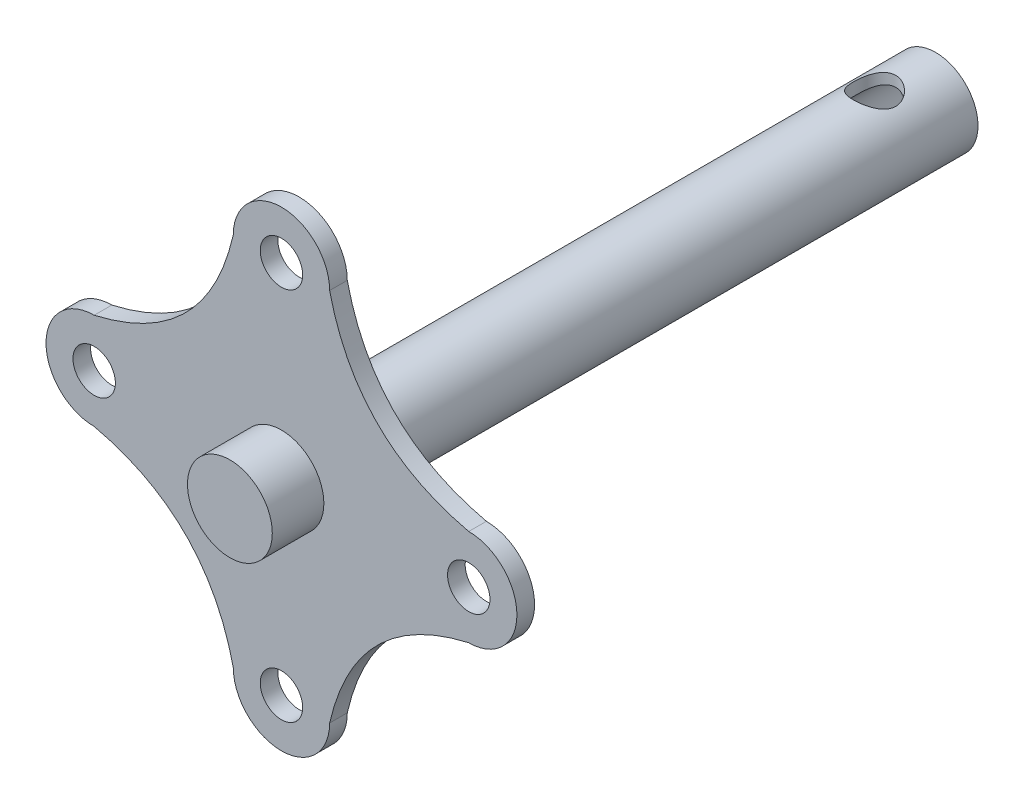
ISO-10303-21;
HEADER;
FILE_DESCRIPTION(('STEP AP214'),'2;1');
FILE_NAME('part.step','',(''),(''),'','','');
FILE_SCHEMA(('AUTOMOTIVE_DESIGN { 1 0 10303 214 1 1 1 1 }'));
ENDSEC;
DATA;
#1=APPLICATION_CONTEXT('core data for automotive mechanical design processes');
#2=APPLICATION_PROTOCOL_DEFINITION('international standard','automotive_design',2000,#1);
#3=PRODUCT_CONTEXT('',#1,'mechanical');
#4=PRODUCT('Part','Part','',(#3));
#5=PRODUCT_RELATED_PRODUCT_CATEGORY('part','',(#4));
#6=PRODUCT_DEFINITION_FORMATION('','',#4);
#7=PRODUCT_DEFINITION_CONTEXT('part definition',#1,'design');
#8=PRODUCT_DEFINITION('design','',#6,#7);
#9=PRODUCT_DEFINITION_SHAPE('','',#8);
#10=(LENGTH_UNIT() NAMED_UNIT(*) SI_UNIT(.MILLI.,.METRE.));
#11=(NAMED_UNIT(*) PLANE_ANGLE_UNIT() SI_UNIT($,.RADIAN.));
#12=(NAMED_UNIT(*) SI_UNIT($,.STERADIAN.) SOLID_ANGLE_UNIT());
#13=UNCERTAINTY_MEASURE_WITH_UNIT(LENGTH_MEASURE(1.E-05),#10,'distance_accuracy_value','');
#14=(GEOMETRIC_REPRESENTATION_CONTEXT(3) GLOBAL_UNCERTAINTY_ASSIGNED_CONTEXT((#13)) GLOBAL_UNIT_ASSIGNED_CONTEXT((#10,
#11,#12)) REPRESENTATION_CONTEXT('',''));
#15=CARTESIAN_POINT('',(0.,0.,0.));
#16=DIRECTION('',(0.,0.,1.));
#17=DIRECTION('',(1.,0.,0.));
#18=AXIS2_PLACEMENT_3D('',#15,#16,#17);
#19=CARTESIAN_POINT('',(-17.9605122421383,17.9605122421383,0.));
#20=DIRECTION('',(0.,0.,1.));
#21=DIRECTION('',(1.,0.,0.));
#22=AXIS2_PLACEMENT_3D('',#19,#20,#21);
#23=PLANE('',#22);
#24=CARTESIAN_POINT('',(-35.052,3.67150211667388E-13,0.));
#25=DIRECTION('',(0.,0.,1.));
#26=DIRECTION('',(1.,0.,0.));
#27=AXIS2_PLACEMENT_3D('',#24,#25,#26);
#28=CIRCLE('',#27,3.96875);
#29=CARTESIAN_POINT('',(-31.08325,3.67150211667388E-13,0.));
#30=VERTEX_POINT('',#29);
#31=EDGE_CURVE('E260',#30,#30,#28,.T.);
#32=ORIENTED_EDGE('',*,*,#31,.T.);
#33=EDGE_LOOP('',(#32));
#34=FACE_BOUND('',#33,.T.);
#35=CARTESIAN_POINT('',(35.052,-1.22383403889129E-13,0.));
#36=DIRECTION('',(0.,0.,1.));
#37=DIRECTION('',(1.,0.,0.));
#38=AXIS2_PLACEMENT_3D('',#35,#36,#37);
#39=CIRCLE('',#38,3.96875);
#40=CARTESIAN_POINT('',(39.02075,-1.22383403889129E-13,0.));
#41=VERTEX_POINT('',#40);
#42=EDGE_CURVE('E271',#41,#41,#39,.T.);
#43=ORIENTED_EDGE('',*,*,#42,.T.);
#44=EDGE_LOOP('',(#43));
#45=FACE_BOUND('',#44,.T.);
#46=CARTESIAN_POINT('',(-9.01700000000001,35.052,0.));
#47=CARTESIAN_POINT('',(-13.8865244842766,13.8865244842766,0.));
#48=CARTESIAN_POINT('',(-35.052,9.017,0.));
#49=B_SPLINE_CURVE_WITH_KNOTS('',2,(#46,#47,#48),.UNSPECIFIED.,.F.,.F.,(3,3),(0.,1.),.UNSPECIFIED.);
#50=CARTESIAN_POINT('',(-9.01700000000001,35.052,0.));
#51=VERTEX_POINT('',#50);
#52=CARTESIAN_POINT('',(-35.052,9.01700000000038,0.));
#53=VERTEX_POINT('',#52);
#54=EDGE_CURVE('E283',#51,#53,#49,.T.);
#55=ORIENTED_EDGE('',*,*,#54,.F.);
#56=CARTESIAN_POINT('',(0.,35.052,0.));
#57=DIRECTION('',(0.,0.,1.));
#58=DIRECTION('',(1.,0.,0.));
#59=AXIS2_PLACEMENT_3D('',#56,#57,#58);
#60=CIRCLE('',#59,9.01700000000001);
#61=CARTESIAN_POINT('',(9.01700000000001,35.052,0.));
#62=VERTEX_POINT('',#61);
#63=EDGE_CURVE('E87',#62,#51,#60,.T.);
#64=ORIENTED_EDGE('',*,*,#63,.F.);
#65=CARTESIAN_POINT('',(35.052,9.01700000000001,0.));
#66=CARTESIAN_POINT('',(13.8865244842766,13.8865244842766,0.));
#67=CARTESIAN_POINT('',(9.01700000000001,35.052,0.));
#68=B_SPLINE_CURVE_WITH_KNOTS('',2,(#65,#66,#67),.UNSPECIFIED.,.F.,.F.,(3,3),(0.,1.),.UNSPECIFIED.);
#69=CARTESIAN_POINT('',(35.052,9.01700000000001,0.));
#70=VERTEX_POINT('',#69);
#71=EDGE_CURVE('E81',#70,#62,#68,.T.);
#72=ORIENTED_EDGE('',*,*,#71,.F.);
#73=CARTESIAN_POINT('',(35.052,-1.22383403889129E-13,0.));
#74=DIRECTION('',(0.,0.,1.));
#75=DIRECTION('',(1.,0.,0.));
#76=AXIS2_PLACEMENT_3D('',#73,#74,#75);
#77=CIRCLE('',#76,9.01700000000001);
#78=CARTESIAN_POINT('',(35.052,-9.01700000000013,0.));
#79=VERTEX_POINT('',#78);
#80=EDGE_CURVE('E124',#79,#70,#77,.T.);
#81=ORIENTED_EDGE('',*,*,#80,.F.);
#82=CARTESIAN_POINT('',(9.01700000000001,-35.052,0.));
#83=CARTESIAN_POINT('',(13.8865244842766,-13.8865244842766,0.));
#84=CARTESIAN_POINT('',(35.052,-9.01700000000001,0.));
#85=B_SPLINE_CURVE_WITH_KNOTS('',2,(#82,#83,#84),.UNSPECIFIED.,.F.,.F.,(3,3),(0.,1.),.UNSPECIFIED.);
#86=CARTESIAN_POINT('',(9.01700000000001,-35.052,0.));
#87=VERTEX_POINT('',#86);
#88=EDGE_CURVE('E331',#87,#79,#85,.T.);
#89=ORIENTED_EDGE('',*,*,#88,.F.);
#90=CARTESIAN_POINT('',(-2.44766807778259E-13,-35.052,0.));
#91=DIRECTION('',(0.,0.,1.));
#92=DIRECTION('',(1.,0.,0.));
#93=AXIS2_PLACEMENT_3D('',#90,#91,#92);
#94=CIRCLE('',#93,9.01700000000001);
#95=CARTESIAN_POINT('',(-9.01700000000026,-35.052,0.));
#96=VERTEX_POINT('',#95);
#97=EDGE_CURVE('E326',#96,#87,#94,.T.);
#98=ORIENTED_EDGE('',*,*,#97,.F.);
#99=CARTESIAN_POINT('',(-35.052,-9.01700000000002,0.));
#100=CARTESIAN_POINT('',(-13.8865244842766,-13.8865244842766,0.));
#101=CARTESIAN_POINT('',(-9.01700000000001,-35.052,0.));
#102=B_SPLINE_CURVE_WITH_KNOTS('',2,(#99,#100,#101),.UNSPECIFIED.,.F.,.F.,(3,3),(0.,1.),.UNSPECIFIED.);
#103=CARTESIAN_POINT('',(-35.052,-9.01700000000002,0.));
#104=VERTEX_POINT('',#103);
#105=EDGE_CURVE('E315',#104,#96,#102,.T.);
#106=ORIENTED_EDGE('',*,*,#105,.F.);
#107=CARTESIAN_POINT('',(-35.052,3.67150211667388E-13,0.));
#108=DIRECTION('',(0.,0.,1.));
#109=DIRECTION('',(1.,0.,0.));
#110=AXIS2_PLACEMENT_3D('',#107,#108,#109);
#111=CIRCLE('',#110,9.01700000000001);
#112=EDGE_CURVE('E312',#53,#104,#111,.T.);
#113=ORIENTED_EDGE('',*,*,#112,.F.);
#114=EDGE_LOOP('',(#55,#64,#72,#81,#89,#98,#106,#113));
#115=FACE_BOUND('',#114,.T.);
#116=CARTESIAN_POINT('',(0.,35.052,0.));
#117=DIRECTION('',(0.,0.,1.));
#118=DIRECTION('',(1.,0.,0.));
#119=AXIS2_PLACEMENT_3D('',#116,#117,#118);
#120=CIRCLE('',#119,3.96875);
#121=CARTESIAN_POINT('',(3.96875,35.052,0.));
#122=VERTEX_POINT('',#121);
#123=EDGE_CURVE('E277',#122,#122,#120,.T.);
#124=ORIENTED_EDGE('',*,*,#123,.T.);
#125=EDGE_LOOP('',(#124));
#126=FACE_BOUND('',#125,.T.);
#127=CARTESIAN_POINT('',(-2.44766807778259E-13,-35.052,0.));
#128=DIRECTION('',(0.,0.,1.));
#129=DIRECTION('',(1.,0.,0.));
#130=AXIS2_PLACEMENT_3D('',#127,#128,#129);
#131=CIRCLE('',#130,3.96875);
#132=CARTESIAN_POINT('',(3.96874999999976,-35.052,0.));
#133=VERTEX_POINT('',#132);
#134=EDGE_CURVE('E266',#133,#133,#131,.T.);
#135=ORIENTED_EDGE('',*,*,#134,.T.);
#136=EDGE_LOOP('',(#135));
#137=FACE_BOUND('',#136,.T.);
#138=CARTESIAN_POINT('',(0.,0.,0.));
#139=DIRECTION('',(0.,0.,1.));
#140=DIRECTION('',(1.,0.,0.));
#141=AXIS2_PLACEMENT_3D('',#138,#139,#140);
#142=CIRCLE('',#141,7.9375);
#143=CARTESIAN_POINT('',(7.9375,0.,0.));
#144=VERTEX_POINT('',#143);
#145=EDGE_CURVE('E11',#144,#144,#142,.F.);
#146=ORIENTED_EDGE('',*,*,#145,.F.);
#147=EDGE_LOOP('',(#146));
#148=FACE_BOUND('',#147,.T.);
#149=ADVANCED_FACE('F34',(#34,#45,#115,#126,#137,#148),#23,.F.);
#150=CARTESIAN_POINT('',(-17.9605122421383,17.9605122421383,3.302));
#151=DIRECTION('',(0.,0.,1.));
#152=DIRECTION('',(1.,0.,0.));
#153=AXIS2_PLACEMENT_3D('',#150,#151,#152);
#154=PLANE('',#153);
#155=CARTESIAN_POINT('',(-35.052,3.67150211667388E-13,3.302));
#156=DIRECTION('',(0.,0.,1.));
#157=DIRECTION('',(1.,0.,0.));
#158=AXIS2_PLACEMENT_3D('',#155,#156,#157);
#159=CIRCLE('',#158,3.96875);
#160=CARTESIAN_POINT('',(-31.08325,3.67150211667388E-13,3.302));
#161=VERTEX_POINT('',#160);
#162=EDGE_CURVE('E263',#161,#161,#159,.T.);
#163=ORIENTED_EDGE('',*,*,#162,.F.);
#164=EDGE_LOOP('',(#163));
#165=FACE_BOUND('',#164,.T.);
#166=CARTESIAN_POINT('',(35.052,-1.22383403889129E-13,3.302));
#167=DIRECTION('',(0.,0.,1.));
#168=DIRECTION('',(1.,0.,0.));
#169=AXIS2_PLACEMENT_3D('',#166,#167,#168);
#170=CIRCLE('',#169,3.96875);
#171=CARTESIAN_POINT('',(39.02075,-1.22383403889129E-13,3.302));
#172=VERTEX_POINT('',#171);
#173=EDGE_CURVE('E274',#172,#172,#170,.T.);
#174=ORIENTED_EDGE('',*,*,#173,.F.);
#175=EDGE_LOOP('',(#174));
#176=FACE_BOUND('',#175,.T.);
#177=CARTESIAN_POINT('',(-9.01700000000001,35.052,3.302));
#178=CARTESIAN_POINT('',(-13.8865244842766,13.8865244842766,3.302));
#179=CARTESIAN_POINT('',(-35.052,9.017,3.302));
#180=B_SPLINE_CURVE_WITH_KNOTS('',2,(#177,#178,#179),.UNSPECIFIED.,.F.,.F.,(3,3),(0.,1.),.UNSPECIFIED.);
#181=CARTESIAN_POINT('',(-9.01700000000001,35.052,3.302));
#182=VERTEX_POINT('',#181);
#183=CARTESIAN_POINT('',(-35.052,9.01700000000038,3.302));
#184=VERTEX_POINT('',#183);
#185=EDGE_CURVE('E285',#182,#184,#180,.T.);
#186=ORIENTED_EDGE('',*,*,#185,.T.);
#187=CARTESIAN_POINT('',(-35.052,3.67150211667388E-13,3.302));
#188=DIRECTION('',(0.,0.,1.));
#189=DIRECTION('',(1.,0.,0.));
#190=AXIS2_PLACEMENT_3D('',#187,#188,#189);
#191=CIRCLE('',#190,9.01700000000001);
#192=CARTESIAN_POINT('',(-35.052,-9.01700000000002,3.302));
#193=VERTEX_POINT('',#192);
#194=EDGE_CURVE('E96',#184,#193,#191,.T.);
#195=ORIENTED_EDGE('',*,*,#194,.T.);
#196=CARTESIAN_POINT('',(-35.052,-9.01700000000002,3.302));
#197=CARTESIAN_POINT('',(-13.8865244842766,-13.8865244842766,3.302));
#198=CARTESIAN_POINT('',(-9.01700000000001,-35.052,3.302));
#199=B_SPLINE_CURVE_WITH_KNOTS('',2,(#196,#197,#198),.UNSPECIFIED.,.F.,.F.,(3,3),(0.,1.),.UNSPECIFIED.);
#200=CARTESIAN_POINT('',(-9.01700000000026,-35.052,3.302));
#201=VERTEX_POINT('',#200);
#202=EDGE_CURVE('E163',#193,#201,#199,.T.);
#203=ORIENTED_EDGE('',*,*,#202,.T.);
#204=CARTESIAN_POINT('',(-2.44766807778259E-13,-35.052,3.302));
#205=DIRECTION('',(0.,0.,1.));
#206=DIRECTION('',(1.,0.,0.));
#207=AXIS2_PLACEMENT_3D('',#204,#205,#206);
#208=CIRCLE('',#207,9.01700000000001);
#209=CARTESIAN_POINT('',(9.01700000000001,-35.052,3.302));
#210=VERTEX_POINT('',#209);
#211=EDGE_CURVE('E158',#201,#210,#208,.T.);
#212=ORIENTED_EDGE('',*,*,#211,.T.);
#213=CARTESIAN_POINT('',(9.01700000000001,-35.052,3.302));
#214=CARTESIAN_POINT('',(13.8865244842766,-13.8865244842766,3.302));
#215=CARTESIAN_POINT('',(35.052,-9.01700000000001,3.302));
#216=B_SPLINE_CURVE_WITH_KNOTS('',2,(#213,#214,#215),.UNSPECIFIED.,.F.,.F.,(3,3),(0.,1.),.UNSPECIFIED.);
#217=CARTESIAN_POINT('',(35.052,-9.01700000000013,3.302));
#218=VERTEX_POINT('',#217);
#219=EDGE_CURVE('E116',#210,#218,#216,.T.);
#220=ORIENTED_EDGE('',*,*,#219,.T.);
#221=CARTESIAN_POINT('',(35.052,-1.22383403889129E-13,3.302));
#222=DIRECTION('',(0.,0.,1.));
#223=DIRECTION('',(1.,0.,0.));
#224=AXIS2_PLACEMENT_3D('',#221,#222,#223);
#225=CIRCLE('',#224,9.01700000000001);
#226=CARTESIAN_POINT('',(35.052,9.01700000000001,3.302));
#227=VERTEX_POINT('',#226);
#228=EDGE_CURVE('E109',#218,#227,#225,.T.);
#229=ORIENTED_EDGE('',*,*,#228,.T.);
#230=CARTESIAN_POINT('',(35.052,9.01700000000001,3.302));
#231=CARTESIAN_POINT('',(13.8865244842766,13.8865244842766,3.302));
#232=CARTESIAN_POINT('',(9.01700000000001,35.052,3.302));
#233=B_SPLINE_CURVE_WITH_KNOTS('',2,(#230,#231,#232),.UNSPECIFIED.,.F.,.F.,(3,3),(0.,1.),.UNSPECIFIED.);
#234=CARTESIAN_POINT('',(9.01700000000001,35.052,3.302));
#235=VERTEX_POINT('',#234);
#236=EDGE_CURVE('E114',#227,#235,#233,.T.);
#237=ORIENTED_EDGE('',*,*,#236,.T.);
#238=CARTESIAN_POINT('',(0.,35.052,3.302));
#239=DIRECTION('',(0.,0.,1.));
#240=DIRECTION('',(1.,0.,0.));
#241=AXIS2_PLACEMENT_3D('',#238,#239,#240);
#242=CIRCLE('',#241,9.01700000000001);
#243=EDGE_CURVE('E52',#235,#182,#242,.T.);
#244=ORIENTED_EDGE('',*,*,#243,.T.);
#245=EDGE_LOOP('',(#186,#195,#203,#212,#220,#229,#237,#244));
#246=FACE_BOUND('',#245,.T.);
#247=CARTESIAN_POINT('',(0.,35.052,3.302));
#248=DIRECTION('',(0.,0.,1.));
#249=DIRECTION('',(1.,0.,0.));
#250=AXIS2_PLACEMENT_3D('',#247,#248,#249);
#251=CIRCLE('',#250,3.96875);
#252=CARTESIAN_POINT('',(3.96875,35.052,3.302));
#253=VERTEX_POINT('',#252);
#254=EDGE_CURVE('E280',#253,#253,#251,.T.);
#255=ORIENTED_EDGE('',*,*,#254,.F.);
#256=EDGE_LOOP('',(#255));
#257=FACE_BOUND('',#256,.T.);
#258=CARTESIAN_POINT('',(-2.44766807778259E-13,-35.052,3.302));
#259=DIRECTION('',(0.,0.,1.));
#260=DIRECTION('',(1.,0.,0.));
#261=AXIS2_PLACEMENT_3D('',#258,#259,#260);
#262=CIRCLE('',#261,3.96875);
#263=CARTESIAN_POINT('',(3.96874999999976,-35.052,3.302));
#264=VERTEX_POINT('',#263);
#265=EDGE_CURVE('E268',#264,#264,#262,.T.);
#266=ORIENTED_EDGE('',*,*,#265,.F.);
#267=EDGE_LOOP('',(#266));
#268=FACE_BOUND('',#267,.T.);
#269=CARTESIAN_POINT('',(0.,0.,3.302));
#270=DIRECTION('',(0.,0.,1.));
#271=DIRECTION('',(1.,0.,0.));
#272=AXIS2_PLACEMENT_3D('',#269,#270,#271);
#273=CIRCLE('',#272,7.9375);
#274=CARTESIAN_POINT('',(7.9375,0.,3.302));
#275=VERTEX_POINT('',#274);
#276=EDGE_CURVE('E256',#275,#275,#273,.T.);
#277=ORIENTED_EDGE('',*,*,#276,.F.);
#278=EDGE_LOOP('',(#277));
#279=FACE_BOUND('',#278,.T.);
#280=ADVANCED_FACE('F111',(#165,#176,#246,#257,#268,#279),#154,.T.);
#281=DIRECTION('',(0.,0.,-1.));
#282=VECTOR('',#281,1.);
#283=SURFACE_OF_LINEAR_EXTRUSION('',#180,#282);
#284=ORIENTED_EDGE('',*,*,#54,.T.);
#285=DIRECTION('',(0.,0.,-1.));
#286=VECTOR('',#285,1.);
#287=CARTESIAN_POINT('',(-35.052,9.01700000000038,3.302));
#288=LINE('',#287,#286);
#289=EDGE_CURVE('E44',#184,#53,#288,.T.);
#290=ORIENTED_EDGE('',*,*,#289,.F.);
#291=ORIENTED_EDGE('',*,*,#185,.F.);
#292=DIRECTION('',(0.,0.,-1.));
#293=VECTOR('',#292,1.);
#294=CARTESIAN_POINT('',(-9.01700000000001,35.052,3.302));
#295=LINE('',#294,#293);
#296=EDGE_CURVE('E130',#182,#51,#295,.T.);
#297=ORIENTED_EDGE('',*,*,#296,.T.);
#298=EDGE_LOOP('',(#284,#290,#291,#297));
#299=FACE_BOUND('',#298,.T.);
#300=ADVANCED_FACE('F36',(#299),#283,.F.);
#301=CARTESIAN_POINT('',(-35.052,3.67150211667388E-13,3.302));
#302=DIRECTION('',(0.,0.,-1.));
#303=DIRECTION('',(-1.,0.,0.));
#304=AXIS2_PLACEMENT_3D('',#301,#302,#303);
#305=CYLINDRICAL_SURFACE('',#304,9.01700000000001);
#306=ORIENTED_EDGE('',*,*,#112,.T.);
#307=DIRECTION('',(0.,0.,-1.));
#308=VECTOR('',#307,1.);
#309=CARTESIAN_POINT('',(-35.052,-9.01700000000002,3.302));
#310=LINE('',#309,#308);
#311=EDGE_CURVE('E309',#193,#104,#310,.T.);
#312=ORIENTED_EDGE('',*,*,#311,.F.);
#313=ORIENTED_EDGE('',*,*,#194,.F.);
#314=ORIENTED_EDGE('',*,*,#289,.T.);
#315=EDGE_LOOP('',(#306,#312,#313,#314));
#316=FACE_BOUND('',#315,.T.);
#317=ADVANCED_FACE('F173',(#316),#305,.T.);
#318=DIRECTION('',(0.,0.,-1.));
#319=VECTOR('',#318,1.);
#320=SURFACE_OF_LINEAR_EXTRUSION('',#199,#319);
#321=ORIENTED_EDGE('',*,*,#105,.T.);
#322=DIRECTION('',(0.,0.,-1.));
#323=VECTOR('',#322,1.);
#324=CARTESIAN_POINT('',(-9.01700000000026,-35.052,3.302));
#325=LINE('',#324,#323);
#326=EDGE_CURVE('E306',#201,#96,#325,.T.);
#327=ORIENTED_EDGE('',*,*,#326,.F.);
#328=ORIENTED_EDGE('',*,*,#202,.F.);
#329=ORIENTED_EDGE('',*,*,#311,.T.);
#330=EDGE_LOOP('',(#321,#327,#328,#329));
#331=FACE_BOUND('',#330,.T.);
#332=ADVANCED_FACE('F171',(#331),#320,.F.);
#333=CARTESIAN_POINT('',(-2.44766807778259E-13,-35.052,3.302));
#334=DIRECTION('',(0.,0.,-1.));
#335=DIRECTION('',(-1.,0.,0.));
#336=AXIS2_PLACEMENT_3D('',#333,#334,#335);
#337=CYLINDRICAL_SURFACE('',#336,9.01700000000001);
#338=ORIENTED_EDGE('',*,*,#97,.T.);
#339=DIRECTION('',(0.,0.,-1.));
#340=VECTOR('',#339,1.);
#341=CARTESIAN_POINT('',(9.01700000000001,-35.052,3.302));
#342=LINE('',#341,#340);
#343=EDGE_CURVE('E303',#210,#87,#342,.T.);
#344=ORIENTED_EDGE('',*,*,#343,.F.);
#345=ORIENTED_EDGE('',*,*,#211,.F.);
#346=ORIENTED_EDGE('',*,*,#326,.T.);
#347=EDGE_LOOP('',(#338,#344,#345,#346));
#348=FACE_BOUND('',#347,.T.);
#349=ADVANCED_FACE('F151',(#348),#337,.T.);
#350=DIRECTION('',(0.,0.,-1.));
#351=VECTOR('',#350,1.);
#352=SURFACE_OF_LINEAR_EXTRUSION('',#216,#351);
#353=ORIENTED_EDGE('',*,*,#88,.T.);
#354=DIRECTION('',(0.,0.,-1.));
#355=VECTOR('',#354,1.);
#356=CARTESIAN_POINT('',(35.052,-9.01700000000013,3.302));
#357=LINE('',#356,#355);
#358=EDGE_CURVE('E125',#218,#79,#357,.T.);
#359=ORIENTED_EDGE('',*,*,#358,.F.);
#360=ORIENTED_EDGE('',*,*,#219,.F.);
#361=ORIENTED_EDGE('',*,*,#343,.T.);
#362=EDGE_LOOP('',(#353,#359,#360,#361));
#363=FACE_BOUND('',#362,.T.);
#364=ADVANCED_FACE('F148',(#363),#352,.F.);
#365=CARTESIAN_POINT('',(35.052,-1.22383403889129E-13,3.302));
#366=DIRECTION('',(0.,0.,-1.));
#367=DIRECTION('',(-1.,0.,0.));
#368=AXIS2_PLACEMENT_3D('',#365,#366,#367);
#369=CYLINDRICAL_SURFACE('',#368,9.01700000000001);
#370=ORIENTED_EDGE('',*,*,#80,.T.);
#371=DIRECTION('',(0.,0.,-1.));
#372=VECTOR('',#371,1.);
#373=CARTESIAN_POINT('',(35.052,9.01700000000001,3.302));
#374=LINE('',#373,#372);
#375=EDGE_CURVE('E121',#227,#70,#374,.T.);
#376=ORIENTED_EDGE('',*,*,#375,.F.);
#377=ORIENTED_EDGE('',*,*,#228,.F.);
#378=ORIENTED_EDGE('',*,*,#358,.T.);
#379=EDGE_LOOP('',(#370,#376,#377,#378));
#380=FACE_BOUND('',#379,.T.);
#381=ADVANCED_FACE('F122',(#380),#369,.T.);
#382=DIRECTION('',(0.,0.,-1.));
#383=VECTOR('',#382,1.);
#384=SURFACE_OF_LINEAR_EXTRUSION('',#233,#383);
#385=ORIENTED_EDGE('',*,*,#71,.T.);
#386=DIRECTION('',(0.,0.,-1.));
#387=VECTOR('',#386,1.);
#388=CARTESIAN_POINT('',(9.01700000000001,35.052,3.302));
#389=LINE('',#388,#387);
#390=EDGE_CURVE('E126',#235,#62,#389,.T.);
#391=ORIENTED_EDGE('',*,*,#390,.F.);
#392=ORIENTED_EDGE('',*,*,#236,.F.);
#393=ORIENTED_EDGE('',*,*,#375,.T.);
#394=EDGE_LOOP('',(#385,#391,#392,#393));
#395=FACE_BOUND('',#394,.T.);
#396=ADVANCED_FACE('F128',(#395),#384,.F.);
#397=CARTESIAN_POINT('',(0.,35.052,3.302));
#398=DIRECTION('',(0.,0.,-1.));
#399=DIRECTION('',(-1.,0.,0.));
#400=AXIS2_PLACEMENT_3D('',#397,#398,#399);
#401=CYLINDRICAL_SURFACE('',#400,9.01700000000001);
#402=ORIENTED_EDGE('',*,*,#63,.T.);
#403=ORIENTED_EDGE('',*,*,#296,.F.);
#404=ORIENTED_EDGE('',*,*,#243,.F.);
#405=ORIENTED_EDGE('',*,*,#390,.T.);
#406=EDGE_LOOP('',(#402,#403,#404,#405));
#407=FACE_BOUND('',#406,.T.);
#408=ADVANCED_FACE('F144',(#407),#401,.T.);
#409=CARTESIAN_POINT('',(0.,35.052,3.302));
#410=DIRECTION('',(0.,0.,-1.));
#411=DIRECTION('',(-1.,0.,0.));
#412=AXIS2_PLACEMENT_3D('',#409,#410,#411);
#413=CYLINDRICAL_SURFACE('',#412,3.96875);
#414=ORIENTED_EDGE('',*,*,#254,.T.);
#415=EDGE_LOOP('',(#414));
#416=FACE_BOUND('',#415,.T.);
#417=ORIENTED_EDGE('',*,*,#123,.F.);
#418=EDGE_LOOP('',(#417));
#419=FACE_BOUND('',#418,.T.);
#420=ADVANCED_FACE('F190',(#416,#419),#413,.F.);
#421=CARTESIAN_POINT('',(35.052,-1.22383403889129E-13,3.302));
#422=DIRECTION('',(0.,0.,-1.));
#423=DIRECTION('',(-1.,0.,0.));
#424=AXIS2_PLACEMENT_3D('',#421,#422,#423);
#425=CYLINDRICAL_SURFACE('',#424,3.96875);
#426=ORIENTED_EDGE('',*,*,#173,.T.);
#427=EDGE_LOOP('',(#426));
#428=FACE_BOUND('',#427,.T.);
#429=ORIENTED_EDGE('',*,*,#42,.F.);
#430=EDGE_LOOP('',(#429));
#431=FACE_BOUND('',#430,.T.);
#432=ADVANCED_FACE('F193',(#428,#431),#425,.F.);
#433=CARTESIAN_POINT('',(-2.44766807778259E-13,-35.052,3.302));
#434=DIRECTION('',(0.,0.,-1.));
#435=DIRECTION('',(-1.,0.,0.));
#436=AXIS2_PLACEMENT_3D('',#433,#434,#435);
#437=CYLINDRICAL_SURFACE('',#436,3.96875);
#438=ORIENTED_EDGE('',*,*,#265,.T.);
#439=EDGE_LOOP('',(#438));
#440=FACE_BOUND('',#439,.T.);
#441=ORIENTED_EDGE('',*,*,#134,.F.);
#442=EDGE_LOOP('',(#441));
#443=FACE_BOUND('',#442,.T.);
#444=ADVANCED_FACE('F197',(#440,#443),#437,.F.);
#445=CARTESIAN_POINT('',(-35.052,3.67150211667388E-13,3.302));
#446=DIRECTION('',(0.,0.,-1.));
#447=DIRECTION('',(-1.,0.,0.));
#448=AXIS2_PLACEMENT_3D('',#445,#446,#447);
#449=CYLINDRICAL_SURFACE('',#448,3.96875);
#450=ORIENTED_EDGE('',*,*,#162,.T.);
#451=EDGE_LOOP('',(#450));
#452=FACE_BOUND('',#451,.T.);
#453=ORIENTED_EDGE('',*,*,#31,.F.);
#454=EDGE_LOOP('',(#453));
#455=FACE_BOUND('',#454,.T.);
#456=ADVANCED_FACE('F201',(#452,#455),#449,.F.);
#457=CARTESIAN_POINT('',(0.,0.,12.954));
#458=DIRECTION('',(0.,0.,-1.));
#459=DIRECTION('',(-1.,0.,0.));
#460=AXIS2_PLACEMENT_3D('',#457,#458,#459);
#461=CYLINDRICAL_SURFACE('',#460,7.9375);
#462=CARTESIAN_POINT('',(0.,0.,12.954));
#463=DIRECTION('',(0.,0.,1.));
#464=DIRECTION('',(1.,0.,0.));
#465=AXIS2_PLACEMENT_3D('',#462,#463,#464);
#466=CIRCLE('',#465,7.9375);
#467=CARTESIAN_POINT('',(7.9375,0.,12.954));
#468=VERTEX_POINT('',#467);
#469=EDGE_CURVE('E257',#468,#468,#466,.T.);
#470=ORIENTED_EDGE('',*,*,#469,.F.);
#471=EDGE_LOOP('',(#470));
#472=FACE_BOUND('',#471,.T.);
#473=ORIENTED_EDGE('',*,*,#276,.T.);
#474=EDGE_LOOP('',(#473));
#475=FACE_BOUND('',#474,.T.);
#476=ADVANCED_FACE('F205',(#472,#475),#461,.T.);
#477=CARTESIAN_POINT('',(0.,0.,12.954));
#478=DIRECTION('',(0.,0.,1.));
#479=DIRECTION('',(1.,0.,0.));
#480=AXIS2_PLACEMENT_3D('',#477,#478,#479);
#481=PLANE('',#480);
#482=ORIENTED_EDGE('',*,*,#469,.T.);
#483=EDGE_LOOP('',(#482));
#484=FACE_BOUND('',#483,.T.);
#485=ADVANCED_FACE('F209',(#484),#481,.T.);
#486=CARTESIAN_POINT('',(0.,0.,-119.126));
#487=DIRECTION('',(0.,0.,1.));
#488=DIRECTION('',(1.,0.,0.));
#489=AXIS2_PLACEMENT_3D('',#486,#487,#488);
#490=CYLINDRICAL_SURFACE('',#489,7.9375);
#491=CARTESIAN_POINT('',(0.,7.93749999999999,-103.72725));
#492=CARTESIAN_POINT('',(0.104369410089829,7.93749964710061,-103.727250401685));
#493=CARTESIAN_POINT('',(0.208746323529613,7.93543652404865,-103.731372000618));
#494=CARTESIAN_POINT('',(0.416729911813045,7.9272367842324,-103.747810186864));
#495=CARTESIAN_POINT('',(0.520336231742607,7.92109839537058,-103.76013033926));
#496=CARTESIAN_POINT('',(0.726110731039585,7.90489272677887,-103.792847002862));
#497=CARTESIAN_POINT('',(0.82827664337823,7.89481984439238,-103.813255031683));
#498=CARTESIAN_POINT('',(1.03030258640491,7.87100738632354,-103.861906916872));
#499=CARTESIAN_POINT('',(1.13016165631416,7.8572663117564,-103.890153976587));
#500=CARTESIAN_POINT('',(1.42440199017918,7.81115458867984,-103.985961135562));
#501=CARTESIAN_POINT('',(1.61448373622076,7.77380867280489,-104.064755457559));
#502=CARTESIAN_POINT('',(1.97834395847019,7.68928332519479,-104.249427407954));
#503=CARTESIAN_POINT('',(2.15212371864541,7.64210466884467,-104.355302900948));
#504=CARTESIAN_POINT('',(2.49041365625516,7.53888923529746,-104.59845990211));
#505=CARTESIAN_POINT('',(2.65372701475934,7.48248923455529,-104.737253901568));
#506=CARTESIAN_POINT('',(2.95584177494967,7.3683815511092,-105.038996425573));
#507=CARTESIAN_POINT('',(3.09462449787672,7.31067290934778,-105.201963184207));
#508=CARTESIAN_POINT('',(3.3546096064078,7.19529548141556,-105.562776026293));
#509=CARTESIAN_POINT('',(3.47361399641898,7.13797684614345,-105.762346919085));
#510=CARTESIAN_POINT('',(3.62524200471708,7.06149696460578,-106.076685051361));
#511=CARTESIAN_POINT('',(3.67131592751051,7.03758021096291,-106.184000173253));
#512=CARTESIAN_POINT('',(3.7540313686651,6.99380755132025,-106.402982213492));
#513=CARTESIAN_POINT('',(3.7906784717335,6.973949242426,-106.514646509907));
#514=CARTESIAN_POINT('',(3.85217834905982,6.94015758970911,-106.734763014468));
#515=CARTESIAN_POINT('',(3.8776017912118,6.92594266308114,-106.84301285339));
#516=CARTESIAN_POINT('',(3.91931981478621,6.9024208871212,-107.061734737486));
#517=CARTESIAN_POINT('',(3.93561923963159,6.89311143390609,-107.172205571333));
#518=CARTESIAN_POINT('',(3.95884711357792,6.87979769947166,-107.394381045861));
#519=CARTESIAN_POINT('',(3.96578120630086,6.87579022326954,-107.506084902556));
#520=CARTESIAN_POINT('',(3.97018212403133,6.87325014427843,-107.729734849304));
#521=CARTESIAN_POINT('',(3.9676498522986,6.87471701913886,-107.841680915226));
#522=CARTESIAN_POINT('',(3.9540316440864,6.882557023164,-108.05136621924));
#523=CARTESIAN_POINT('',(3.94400811209084,6.88832056579457,-108.149198943951));
#524=CARTESIAN_POINT('',(3.91679667622581,6.90382839940708,-108.343552771446));
#525=CARTESIAN_POINT('',(3.89960652217992,6.913573940638,-108.440073452438));
#526=CARTESIAN_POINT('',(3.83755551593145,6.94833703678735,-108.726663670924));
#527=CARTESIAN_POINT('',(3.78220441315265,6.97888716992628,-108.913905648823));
#528=CARTESIAN_POINT('',(3.64414196450859,7.05197183776459,-109.280470189546));
#529=CARTESIAN_POINT('',(3.56082334971471,7.09476894900454,-109.459506695853));
#530=CARTESIAN_POINT('',(3.36963314536097,7.18754170992462,-109.801947919929));
#531=CARTESIAN_POINT('',(3.26175052720868,7.23752058029641,-109.965345569314));
#532=CARTESIAN_POINT('',(3.00858289843047,7.34667673244783,-110.293629109191));
#533=CARTESIAN_POINT('',(2.86028985758813,7.40621681108501,-110.456076683437));
#534=CARTESIAN_POINT('',(2.53820246112426,7.52267817944741,-110.754873984575));
#535=CARTESIAN_POINT('',(2.36439598770339,7.57959820779118,-110.891211238861));
#536=CARTESIAN_POINT('',(2.08304281490361,7.65996142001121,-111.076137772166));
#537=CARTESIAN_POINT('',(1.98335106121145,7.68643989980452,-111.135598308505));
#538=CARTESIAN_POINT('',(1.77856405970502,7.73638797457795,-111.245815178161));
#539=CARTESIAN_POINT('',(1.67347111414213,7.7598588368905,-111.296575180723));
#540=CARTESIAN_POINT('',(1.45861724535511,7.80309870748913,-111.388841629229));
#541=CARTESIAN_POINT('',(1.34885822252743,7.82286920546371,-111.430351800249));
#542=CARTESIAN_POINT('',(1.12546755793707,7.85811727288069,-111.503638532782));
#543=CARTESIAN_POINT('',(1.01183636334388,7.87359533615191,-111.535416214027));
#544=CARTESIAN_POINT('',(0.791208415491776,7.89868242604485,-111.586592263106));
#545=CARTESIAN_POINT('',(0.684441602894769,7.90867135755798,-111.606797912705));
#546=CARTESIAN_POINT('',(0.469303417873443,7.9243478563447,-111.638403897866));
#547=CARTESIAN_POINT('',(0.360932188154226,7.93003580385413,-111.649805011809));
#548=CARTESIAN_POINT('',(0.14351838140585,7.93694735700268,-111.663649139736));
#549=CARTESIAN_POINT('',(0.0344760774196125,7.93817267176881,-111.666095583235));
#550=CARTESIAN_POINT('',(-0.183393594918013,7.93612884272146,-111.662007353531));
#551=CARTESIAN_POINT('',(-0.292220972568113,7.9328598978143,-111.655473077795));
#552=CARTESIAN_POINT('',(-0.500320083529768,7.92234666698602,-111.63436567711));
#553=CARTESIAN_POINT('',(-0.599676397866461,7.91543153005083,-111.620457689248));
#554=CARTESIAN_POINT('',(-0.796761893609953,7.8980306181852,-111.585239665958));
#555=CARTESIAN_POINT('',(-0.894490510702848,7.88754363087236,-111.563927117174));
#556=CARTESIAN_POINT('',(-1.18419302276536,7.85107181593958,-111.489197132444));
#557=CARTESIAN_POINT('',(-1.37287107818242,7.82006600845009,-111.424967907383));
#558=CARTESIAN_POINT('',(-1.74186943050378,7.74637387784252,-111.26787687632));
#559=CARTESIAN_POINT('',(-1.92179650921422,7.70337892840573,-111.174248904181));
#560=CARTESIAN_POINT('',(-2.26401140510817,7.60983879747084,-110.961853583195));
#561=CARTESIAN_POINT('',(-2.42629166335538,7.55929040232657,-110.843075525123));
#562=CARTESIAN_POINT('',(-2.74545105225973,7.4496720486414,-110.570334326544));
#563=CARTESIAN_POINT('',(-2.90023484753893,7.39025272428329,-110.414061404438));
#564=CARTESIAN_POINT('',(-3.18238412157331,7.27321792607378,-110.077512368849));
#565=CARTESIAN_POINT('',(-3.30973063302717,7.21560372346056,-109.897219789113));
#566=CARTESIAN_POINT('',(-3.48032517112611,7.13410756555508,-109.606959063816));
#567=CARTESIAN_POINT('',(-3.53478285096046,7.10720459960475,-109.504277833427));
#568=CARTESIAN_POINT('',(-3.63472626965576,7.05661423482835,-109.293899677459));
#569=CARTESIAN_POINT('',(-3.68021633321872,7.03292528774383,-109.186205200687));
#570=CARTESIAN_POINT('',(-3.76169238454403,6.98968572556066,-108.96657383624));
#571=CARTESIAN_POINT('',(-3.79768600142671,6.97013179105682,-108.854640437156));
#572=CARTESIAN_POINT('',(-3.85972848253965,6.93596861212021,-108.627314029593));
#573=CARTESIAN_POINT('',(-3.88577888656023,6.92135860211885,-108.511921559768));
#574=CARTESIAN_POINT('',(-3.92552100991457,6.89888830107335,-108.289911399127));
#575=CARTESIAN_POINT('',(-3.94015890862892,6.89051477606184,-108.183514470474));
#576=CARTESIAN_POINT('',(-3.96076406455219,6.87869148958232,-107.969617858473));
#577=CARTESIAN_POINT('',(-3.96673223020604,6.87524121223989,-107.862118291853));
#578=CARTESIAN_POINT('',(-3.96990399660637,6.873410736258,-107.646978499338));
#579=CARTESIAN_POINT('',(-3.96711067808675,6.87502875549179,-107.539338336185));
#580=CARTESIAN_POINT('',(-3.95282195577091,6.88325209939153,-107.324861205598));
#581=CARTESIAN_POINT('',(-3.94132690821957,6.88985721988777,-107.218024205465));
#582=CARTESIAN_POINT('',(-3.89701731529281,6.91507935211119,-106.920307676529));
#583=CARTESIAN_POINT('',(-3.85448259337964,6.93908910453775,-106.731230741025));
#584=CARTESIAN_POINT('',(-3.74322760725249,6.99972091146971,-106.363225782623));
#585=CARTESIAN_POINT('',(-3.67449891980817,7.03634702267057,-106.184301045669));
#586=CARTESIAN_POINT('',(-3.50764414414007,7.1210708289439,-105.82821838831));
#587=CARTESIAN_POINT('',(-3.4078532129875,7.16977392107559,-105.651986816236));
#588=CARTESIAN_POINT('',(-3.18353453279148,7.2721522858031,-105.317625380928));
#589=CARTESIAN_POINT('',(-3.05899391421101,7.32583013743155,-105.15950500301));
#590=CARTESIAN_POINT('',(-2.77100358220972,7.4399095177021,-104.845878988688));
#591=CARTESIAN_POINT('',(-2.60466485397247,7.50033552370546,-104.693025538576));
#592=CARTESIAN_POINT('',(-2.24689081707859,7.61515429445718,-104.41675242424));
#593=CARTESIAN_POINT('',(-2.0554420667032,7.66954379879205,-104.293348625268));
#594=CARTESIAN_POINT('',(-1.752233949863,7.74238841685192,-104.133149690033));
#595=CARTESIAN_POINT('',(-1.64802750917782,7.76528966617126,-104.083749277664));
#596=CARTESIAN_POINT('',(-1.43509626570137,7.80744204084633,-103.994000654147));
#597=CARTESIAN_POINT('',(-1.32637371391815,7.82669495867774,-103.953647995917));
#598=CARTESIAN_POINT('',(-1.10545166494248,7.86093871740178,-103.882550814507));
#599=CARTESIAN_POINT('',(-0.993260348832235,7.87593884757798,-103.851785335421));
#600=CARTESIAN_POINT('',(-0.766157034396538,7.90126228219691,-103.800165779984));
#601=CARTESIAN_POINT('',(-0.65124674319286,7.91158844330997,-103.779305649226));
#602=CARTESIAN_POINT('',(-0.446914305999841,7.92540632621577,-103.751479594592));
#603=CARTESIAN_POINT('',(-0.357842962446189,7.92993350293085,-103.742401309177));
#604=CARTESIAN_POINT('',(-0.179182931830079,7.9359805327966,-103.730286256094));
#605=CARTESIAN_POINT('',(-0.0895942305566305,7.93750030294076,-103.72724965518));
#606=CARTESIAN_POINT('',(0.,7.93749999999999,-103.72725));
#607=B_SPLINE_CURVE_WITH_KNOTS('',3,(#491,#492,#493,#494,#495,#496,#497,#498,#499,#500,#501,
#502,#503,#504,#505,#506,#507,#508,#509,#510,#511,#512,#513,#514,#515,#516,#517,#518,#519,#520,
#521,#522,#523,#524,#525,#526,#527,#528,#529,#530,#531,#532,#533,#534,#535,#536,#537,#538,#539,
#540,#541,#542,#543,#544,#545,#546,#547,#548,#549,#550,#551,#552,#553,#554,#555,#556,#557,#558,
#559,#560,#561,#562,#563,#564,#565,#566,#567,#568,#569,#570,#571,#572,#573,#574,#575,#576,#577,
#578,#579,#580,#581,#582,#583,#584,#585,#586,#587,#588,#589,#590,#591,#592,#593,#594,#595,#596,
#597,#598,#599,#600,#601,#602,#603,#604,#605,#606),.UNSPECIFIED.,.T.,.F.,(4,2,2,2,2,2,2,2,2,2,2,
2,2,2,2,2,2,2,2,2,2,2,2,2,2,2,2,2,2,2,2,2,2,2,2,2,2,2,2,2,2,2,2,2,2,2,2,2,2,2,2,2,2,2,2,2,2,4),
(0.,0.313019515128351,0.626175233580018,0.939778516116712,1.25351013887969,1.87785009933137,
2.50214084452941,3.16419977463372,3.82676067541077,4.54070318744182,4.89791582095783,
5.25491634195222,5.5907403388691,5.92638589641845,6.2618291009652,6.59724029907381,
6.89242045929007,7.18769337007426,7.7778104396881,8.38167306557457,8.98580734640278,
9.66654401807603,10.3476050632731,10.7043834335805,11.0610109688386,11.4174946231157,
11.773937248231,12.1008595463039,12.4277529388723,12.7545211225897,13.0812748447114,
13.382601220787,13.6840299772615,14.2863280775274,14.905847348907,15.5256309518745,
16.2062779227394,16.8873939234647,17.2448954524988,17.6022241496148,17.9592649009089,
18.3162503389791,18.6389736088749,18.9616630602592,19.2842390595328,19.6068018534042,
20.1898457717762,20.7730773388125,21.3954935434924,22.0182342479126,22.7166422369348,
23.4154256304279,23.7677430677371,24.1198869552545,24.4712556289908,24.8224092597297,
25.0911083791426,25.3598149147358),.UNSPECIFIED.);
#608=CARTESIAN_POINT('',(0.,7.93749999999999,-103.72725));
#609=VERTEX_POINT('',#608);
#610=EDGE_CURVE('E236',#609,#609,#607,.T.);
#611=ORIENTED_EDGE('',*,*,#610,.F.);
#612=EDGE_LOOP('',(#611));
#613=FACE_BOUND('',#612,.T.);
#614=CARTESIAN_POINT('',(0.,0.,-119.126));
#615=DIRECTION('',(0.,0.,-1.));
#616=DIRECTION('',(-1.,0.,0.));
#617=AXIS2_PLACEMENT_3D('',#614,#615,#616);
#618=CIRCLE('',#617,7.9375);
#619=CARTESIAN_POINT('',(-7.9375,0.,-119.126));
#620=VERTEX_POINT('',#619);
#621=EDGE_CURVE('E251',#620,#620,#618,.T.);
#622=ORIENTED_EDGE('',*,*,#621,.F.);
#623=EDGE_LOOP('',(#622));
#624=FACE_BOUND('',#623,.T.);
#625=ORIENTED_EDGE('',*,*,#145,.T.);
#626=EDGE_LOOP('',(#625));
#627=FACE_BOUND('',#626,.T.);
#628=ADVANCED_FACE('F213',(#613,#624,#627),#490,.T.);
#629=CARTESIAN_POINT('',(0.,0.,-119.126));
#630=DIRECTION('',(0.,0.,-1.));
#631=DIRECTION('',(-1.,0.,0.));
#632=AXIS2_PLACEMENT_3D('',#629,#630,#631);
#633=PLANE('',#632);
#634=CARTESIAN_POINT('',(0.,0.,-119.126));
#635=DIRECTION('',(0.,0.,-1.));
#636=DIRECTION('',(-1.,0.,0.));
#637=AXIS2_PLACEMENT_3D('',#634,#635,#636);
#638=CIRCLE('',#637,6.);
#639=CARTESIAN_POINT('',(-6.,0.,-119.126));
#640=VERTEX_POINT('',#639);
#641=EDGE_CURVE('E241',#640,#640,#638,.T.);
#642=ORIENTED_EDGE('',*,*,#641,.F.);
#643=EDGE_LOOP('',(#642));
#644=FACE_BOUND('',#643,.T.);
#645=ORIENTED_EDGE('',*,*,#621,.T.);
#646=EDGE_LOOP('',(#645));
#647=FACE_BOUND('',#646,.T.);
#648=ADVANCED_FACE('F217',(#644,#647),#633,.T.);
#649=CARTESIAN_POINT('',(0.,0.,-93.726));
#650=DIRECTION('',(0.,0.,-1.));
#651=DIRECTION('',(-1.,0.,0.));
#652=AXIS2_PLACEMENT_3D('',#649,#650,#651);
#653=CYLINDRICAL_SURFACE('',#652,6.);
#654=CARTESIAN_POINT('',(0.,5.99999999999999,-103.72725));
#655=CARTESIAN_POINT('',(-0.199688241899246,5.99999480449547,-103.727255934771));
#656=CARTESIAN_POINT('',(-0.399412118749351,5.98994170323583,-103.74240720941));
#657=CARTESIAN_POINT('',(-0.792503156233868,5.95071732686105,-103.802093551846));
#658=CARTESIAN_POINT('',(-0.985866536799252,5.92153489123459,-103.846645772959));
#659=CARTESIAN_POINT('',(-1.35997338842435,5.84694145233489,-103.962416682267));
#660=CARTESIAN_POINT('',(-1.54077142559262,5.80160664129876,-104.033510246559));
#661=CARTESIAN_POINT('',(-1.88716194632441,5.69836174167826,-104.199357190159));
#662=CARTESIAN_POINT('',(-2.0527523853595,5.64044996574229,-104.2941137444));
#663=CARTESIAN_POINT('',(-2.37976318975356,5.51091809413261,-104.513285286984));
#664=CARTESIAN_POINT('',(-2.53965621988328,5.43855405571732,-104.639526681582));
#665=CARTESIAN_POINT('',(-2.83750393678586,5.28926719148151,-104.913804374019));
#666=CARTESIAN_POINT('',(-2.97542690791732,5.212337991299,-105.061871596541));
#667=CARTESIAN_POINT('',(-3.17426637118122,5.09227759438559,-105.310918142459));
#668=CARTESIAN_POINT('',(-3.24311435969634,5.04858615703532,-105.40539350876));
#669=CARTESIAN_POINT('',(-3.37255445584984,4.96305337538249,-105.600625143378));
#670=CARTESIAN_POINT('',(-3.43314473087889,4.92121244314408,-105.701382798698));
#671=CARTESIAN_POINT('',(-3.60166737352307,4.80072642451339,-106.012433511099));
#672=CARTESIAN_POINT('',(-3.69675565692832,4.72686166894306,-106.232006932129));
#673=CARTESIAN_POINT('',(-3.82558161059636,4.62274474361867,-106.625614176715));
#674=CARTESIAN_POINT('',(-3.86908126731148,4.58606252379742,-106.794785160478));
#675=CARTESIAN_POINT('',(-3.93354187930729,4.53090363229434,-107.140170342465));
#676=CARTESIAN_POINT('',(-3.95454076640918,4.51239632573814,-107.316372166166));
#677=CARTESIAN_POINT('',(-3.97267380249735,4.49644763048188,-107.671677587412));
#678=CARTESIAN_POINT('',(-3.96971547066543,4.49908787615954,-107.850789763677));
#679=CARTESIAN_POINT('',(-3.93993533193668,4.52518074305671,-108.205537345464));
#680=CARTESIAN_POINT('',(-3.91309335034085,4.54865095946656,-108.381169683297));
#681=CARTESIAN_POINT('',(-3.83885271800793,4.61144409190743,-108.717079273625));
#682=CARTESIAN_POINT('',(-3.79234456661841,4.65007559830046,-108.877690951433));
#683=CARTESIAN_POINT('',(-3.68094105863484,4.73874764824864,-109.188988138361));
#684=CARTESIAN_POINT('',(-3.61603966502415,4.78879193664382,-109.339670368397));
#685=CARTESIAN_POINT('',(-3.45471343619861,4.90681399522487,-109.659189296692));
#686=CARTESIAN_POINT('',(-3.3545710126125,4.97637313445497,-109.825560062367));
#687=CARTESIAN_POINT('',(-3.132083186795,5.11933473524399,-110.141068190503));
#688=CARTESIAN_POINT('',(-3.009710538925,5.19274183348345,-110.290184033878));
#689=CARTESIAN_POINT('',(-2.7163744308966,5.35301274064015,-110.598858366632));
#690=CARTESIAN_POINT('',(-2.54060023243892,5.43948670971388,-110.754098503529));
#691=CARTESIAN_POINT('',(-2.16105521366338,5.6010946277321,-111.033082698374));
#692=CARTESIAN_POINT('',(-1.9573117617737,5.67623951339386,-111.156857212443));
#693=CARTESIAN_POINT('',(-1.56837751755918,5.79422112579277,-111.346799114572));
#694=CARTESIAN_POINT('',(-1.38743291423213,5.84050599787016,-111.419510678165));
#695=CARTESIAN_POINT('',(-1.01370922497883,5.91681157823586,-111.538097215872));
#696=CARTESIAN_POINT('',(-0.820940215797119,5.94684592657038,-111.583994699253));
#697=CARTESIAN_POINT('',(-0.427860368662627,5.98799791522144,-111.646653388107));
#698=CARTESIAN_POINT('',(-0.22752189370409,5.99903763371252,-111.663294581311));
#699=CARTESIAN_POINT('',(0.173464236792857,6.00084060614348,-111.666021339139));
#700=CARTESIAN_POINT('',(0.374111879362019,5.99160468866438,-111.652108152395));
#701=CARTESIAN_POINT('',(0.755919043539722,5.95507667050708,-111.596551853701));
#702=CARTESIAN_POINT('',(0.937485270228521,5.92903131173169,-111.556822227569));
#703=CARTESIAN_POINT('',(1.29079381527299,5.86226939374606,-111.453489827964));
#704=CARTESIAN_POINT('',(1.46253455296001,5.82155048158574,-111.389883225676));
#705=CARTESIAN_POINT('',(1.80350866629869,5.72544404559256,-111.23654854987));
#706=CARTESIAN_POINT('',(1.9718891492285,5.66928879564898,-111.145417370292));
#707=CARTESIAN_POINT('',(2.29158447362555,5.54778714833963,-110.941857006495));
#708=CARTESIAN_POINT('',(2.44288810981525,5.48243477857779,-110.829413966262));
#709=CARTESIAN_POINT('',(2.74929017936081,5.33615525241409,-110.566423609391));
#710=CARTESIAN_POINT('',(2.90123608302176,5.25439586436395,-110.412664347605));
#711=CARTESIAN_POINT('',(3.17851953670356,5.09145217289594,-110.082322806009));
#712=CARTESIAN_POINT('',(3.30384100144254,5.01026824561032,-109.905726832337));
#713=CARTESIAN_POINT('',(3.51479025381925,4.86426641514167,-109.549598625512));
#714=CARTESIAN_POINT('',(3.60307908492691,4.79862530410086,-109.371988596684));
#715=CARTESIAN_POINT('',(3.75320665391248,4.68214786816462,-109.001448456547));
#716=CARTESIAN_POINT('',(3.81509313709127,4.63128487252686,-108.808546754131));
#717=CARTESIAN_POINT('',(3.90111325521458,4.5589412008375,-108.444980395906));
#718=CARTESIAN_POINT('',(3.9298853699327,4.53392895149,-108.276133789411));
#719=CARTESIAN_POINT('',(3.96529068740479,4.50300608981435,-107.934463426665));
#720=CARTESIAN_POINT('',(3.9719457320021,4.49707663234535,-107.761643764011));
#721=CARTESIAN_POINT('',(3.9626886283762,4.50523293593088,-107.417086872794));
#722=CARTESIAN_POINT('',(3.94677300758952,4.51932177686032,-107.245349814878));
#723=CARTESIAN_POINT('',(3.89342868495316,4.56534867933065,-106.907640953491));
#724=CARTESIAN_POINT('',(3.85597151056696,4.59731036274212,-106.741677089227));
#725=CARTESIAN_POINT('',(3.7483858394138,4.6856856034456,-106.374403200005));
#726=CARTESIAN_POINT('',(3.67209903354383,4.74640996183613,-106.175953725852));
#727=CARTESIAN_POINT('',(3.49135681473403,4.88088977376916,-105.797156552262));
#728=CARTESIAN_POINT('',(3.38686217614804,4.95466332381565,-105.61683454364));
#729=CARTESIAN_POINT('',(3.15032847505382,5.1083951249131,-105.273048448887));
#730=CARTESIAN_POINT('',(3.01784142115897,5.18843870781307,-105.109932628655));
#731=CARTESIAN_POINT('',(2.72810542536272,5.34646019132039,-104.80593725446));
#732=CARTESIAN_POINT('',(2.57084925816244,5.4244374813996,-104.665064212935));
#733=CARTESIAN_POINT('',(2.30687670168467,5.53978244739492,-104.464335910648));
#734=CARTESIAN_POINT('',(2.20787706267843,5.58007747811434,-104.395868042238));
#735=CARTESIAN_POINT('',(2.00300850877088,5.65684570932489,-104.267658953898));
#736=CARTESIAN_POINT('',(1.89714288462219,5.69332071908751,-104.207913597405));
#737=CARTESIAN_POINT('',(1.67921924892099,5.76135666279718,-104.097935107499));
#738=CARTESIAN_POINT('',(1.56716843689995,5.79292315336017,-104.047691203969));
#739=CARTESIAN_POINT('',(1.33764362741478,5.85018926805326,-103.95743035442));
#740=CARTESIAN_POINT('',(1.22017179484732,5.87589121024086,-103.917409366879));
#741=CARTESIAN_POINT('',(0.923721266631328,5.93118314039515,-103.831875873456));
#742=CARTESIAN_POINT('',(0.742060144041873,5.95680917391995,-103.792803290004));
#743=CARTESIAN_POINT('',(0.373607717885417,5.9912151482713,-103.740495070529));
#744=CARTESIAN_POINT('',(0.186819453942688,6.00000486068337,-103.727244447692));
#745=CARTESIAN_POINT('',(0.,5.99999999999999,-103.72725));
#746=B_SPLINE_CURVE_WITH_KNOTS('',3,(#654,#655,#656,#657,#658,#659,#660,#661,#662,#663,#664,
#665,#666,#667,#668,#669,#670,#671,#672,#673,#674,#675,#676,#677,#678,#679,#680,#681,#682,#683,
#684,#685,#686,#687,#688,#689,#690,#691,#692,#693,#694,#695,#696,#697,#698,#699,#700,#701,#702,
#703,#704,#705,#706,#707,#708,#709,#710,#711,#712,#713,#714,#715,#716,#717,#718,#719,#720,#721,
#722,#723,#724,#725,#726,#727,#728,#729,#730,#731,#732,#733,#734,#735,#736,#737,#738,#739,#740,
#741,#742,#743,#744,#745),.UNSPECIFIED.,.T.,.F.,(4,2,2,2,2,2,2,2,2,2,2,2,2,2,2,2,2,2,2,2,2,2,2,
2,2,2,2,2,2,2,2,2,2,2,2,2,2,2,2,2,2,2,2,2,2,4),(0.,0.598332163874795,1.19701372011503,
1.79290783681776,2.38888194934874,3.03507868383437,3.6821999656922,4.05618084258823,
4.43024458124592,5.1763156303618,5.70969296857651,6.2421697171931,6.77670293534247,
7.31168810683189,7.82467884242143,8.33783814684698,8.95447158630046,9.57186594174099,
10.3181449312462,11.06369881032,11.6624512752862,12.2607003884099,12.8613979036489,
13.4620708713326,14.0226383162393,14.5832956899131,15.1795818557391,15.7762570381763,
16.4668668529848,17.1578927238993,17.7823401523762,18.4056535103473,18.9226666785531,
19.4391691153857,19.9557510262638,20.4730173034179,21.1328062910807,21.7935175464186,
22.4657349945861,23.1381488970186,23.5184938327593,23.8986578037079,24.2783882325113,
24.6579683057111,25.2180664876593,25.777839497168),.UNSPECIFIED.);
#747=CARTESIAN_POINT('',(0.,5.99999999999999,-103.72725));
#748=VERTEX_POINT('',#747);
#749=EDGE_CURVE('E242',#748,#748,#746,.T.);
#750=ORIENTED_EDGE('',*,*,#749,.F.);
#751=EDGE_LOOP('',(#750));
#752=FACE_BOUND('',#751,.T.);
#753=CARTESIAN_POINT('',(0.,0.,-93.726));
#754=DIRECTION('',(0.,0.,-1.));
#755=DIRECTION('',(-1.,0.,0.));
#756=AXIS2_PLACEMENT_3D('',#753,#754,#755);
#757=CIRCLE('',#756,6.);
#758=CARTESIAN_POINT('',(-6.,0.,-93.726));
#759=VERTEX_POINT('',#758);
#760=EDGE_CURVE('E247',#759,#759,#757,.T.);
#761=ORIENTED_EDGE('',*,*,#760,.F.);
#762=EDGE_LOOP('',(#761));
#763=FACE_BOUND('',#762,.T.);
#764=ORIENTED_EDGE('',*,*,#641,.T.);
#765=EDGE_LOOP('',(#764));
#766=FACE_BOUND('',#765,.T.);
#767=ADVANCED_FACE('F221',(#752,#763,#766),#653,.F.);
#768=CARTESIAN_POINT('',(0.,0.,-93.726));
#769=DIRECTION('',(0.,0.,-1.));
#770=DIRECTION('',(-1.,0.,0.));
#771=AXIS2_PLACEMENT_3D('',#768,#769,#770);
#772=PLANE('',#771);
#773=ORIENTED_EDGE('',*,*,#760,.T.);
#774=EDGE_LOOP('',(#773));
#775=FACE_BOUND('',#774,.T.);
#776=ADVANCED_FACE('F225',(#775),#772,.T.);
#777=CARTESIAN_POINT('',(0.,-44.07,-107.696));
#778=DIRECTION('',(0.,1.,0.));
#779=DIRECTION('',(0.,0.,1.));
#780=AXIS2_PLACEMENT_3D('',#777,#778,#779);
#781=CYLINDRICAL_SURFACE('',#780,3.96875);
#782=ORIENTED_EDGE('',*,*,#749,.T.);
#783=EDGE_LOOP('',(#782));
#784=FACE_BOUND('',#783,.T.);
#785=ORIENTED_EDGE('',*,*,#610,.T.);
#786=EDGE_LOOP('',(#785));
#787=FACE_BOUND('',#786,.T.);
#788=ADVANCED_FACE('F229',(#784,#787),#781,.F.);
#789=CLOSED_SHELL('',(#149,#280,#300,#317,#332,#349,#364,#381,#396,#408,#420,#432,#444,#456,
#476,#485,#628,#648,#767,#776,#788));
#790=MANIFOLD_SOLID_BREP('B2',#789);
#791=ADVANCED_BREP_SHAPE_REPRESENTATION('',(#18,#790),#14);
#792=SHAPE_DEFINITION_REPRESENTATION(#9,#791);
ENDSEC;
END-ISO-10303-21;
